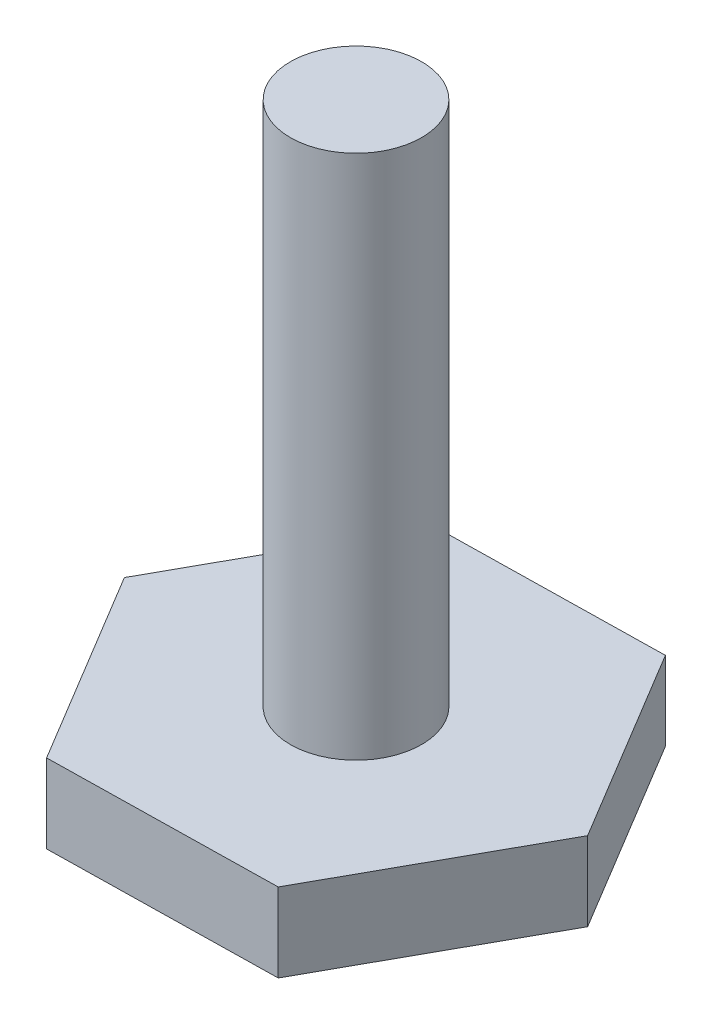
ISO-10303-21;
HEADER;
FILE_DESCRIPTION(('STEP AP214'),'2;1');
FILE_NAME('part.step','',(''),(''),'','','');
FILE_SCHEMA(('AUTOMOTIVE_DESIGN { 1 0 10303 214 1 1 1 1 }'));
ENDSEC;
DATA;
#1=APPLICATION_CONTEXT('core data for automotive mechanical design processes');
#2=APPLICATION_PROTOCOL_DEFINITION('international standard','automotive_design',2000,#1);
#3=PRODUCT_CONTEXT('',#1,'mechanical');
#4=PRODUCT('Part','Part','',(#3));
#5=PRODUCT_RELATED_PRODUCT_CATEGORY('part','',(#4));
#6=PRODUCT_DEFINITION_FORMATION('','',#4);
#7=PRODUCT_DEFINITION_CONTEXT('part definition',#1,'design');
#8=PRODUCT_DEFINITION('design','',#6,#7);
#9=PRODUCT_DEFINITION_SHAPE('','',#8);
#10=(LENGTH_UNIT() NAMED_UNIT(*) SI_UNIT(.MILLI.,.METRE.));
#11=(NAMED_UNIT(*) PLANE_ANGLE_UNIT() SI_UNIT($,.RADIAN.));
#12=(NAMED_UNIT(*) SI_UNIT($,.STERADIAN.) SOLID_ANGLE_UNIT());
#13=UNCERTAINTY_MEASURE_WITH_UNIT(LENGTH_MEASURE(1.E-05),#10,'distance_accuracy_value','');
#14=(GEOMETRIC_REPRESENTATION_CONTEXT(3) GLOBAL_UNCERTAINTY_ASSIGNED_CONTEXT((#13)) GLOBAL_UNIT_ASSIGNED_CONTEXT((#10,
#11,#12)) REPRESENTATION_CONTEXT('',''));
#15=CARTESIAN_POINT('',(0.,0.,0.));
#16=DIRECTION('',(0.,0.,1.));
#17=DIRECTION('',(1.,0.,0.));
#18=AXIS2_PLACEMENT_3D('',#15,#16,#17);
#19=CARTESIAN_POINT('',(17.8510178826156,12.,29.6873905986117));
#20=DIRECTION('',(0.,1.,0.));
#21=DIRECTION('',(0.,0.,1.));
#22=AXIS2_PLACEMENT_3D('',#19,#20,#21);
#23=PLANE('',#22);
#24=DIRECTION('',(0.999842014461216,0.,-0.0177748732242399));
#25=VECTOR('',#24,1.);
#26=CARTESIAN_POINT('',(-16.7845254891612,12.,30.3031302690613));
#27=LINE('',#26,#25);
#28=CARTESIAN_POINT('',(-16.7845254891612,12.,30.3031302690613));
#29=VERTEX_POINT('',#28);
#30=CARTESIAN_POINT('',(17.8510178826156,12.,29.6873905986117));
#31=VERTEX_POINT('',#30);
#32=EDGE_CURVE('E127',#29,#31,#27,.T.);
#33=ORIENTED_EDGE('',*,*,#32,.T.);
#34=DIRECTION('',(0.484527515469368,0.,-0.874776020906541));
#35=VECTOR('',#34,1.);
#36=CARTESIAN_POINT('',(17.8510178826156,12.,29.6873905986117));
#37=LINE('',#36,#35);
#38=CARTESIAN_POINT('',(34.6355433717768,12.,-0.615739670449589));
#39=VERTEX_POINT('',#38);
#40=EDGE_CURVE('E85',#31,#39,#37,.T.);
#41=ORIENTED_EDGE('',*,*,#40,.T.);
#42=DIRECTION('',(-0.515314498991847,0.,-0.857001147682301));
#43=VECTOR('',#42,1.);
#44=CARTESIAN_POINT('',(34.6355433717768,12.,-0.615739670449589));
#45=LINE('',#44,#43);
#46=CARTESIAN_POINT('',(16.7845254891612,12.,-30.3031302690613));
#47=VERTEX_POINT('',#46);
#48=EDGE_CURVE('E98',#39,#47,#45,.T.);
#49=ORIENTED_EDGE('',*,*,#48,.T.);
#50=DIRECTION('',(-0.999842014461216,0.,0.0177748732242397));
#51=VECTOR('',#50,1.);
#52=CARTESIAN_POINT('',(16.7845254891612,12.,-30.3031302690613));
#53=LINE('',#52,#51);
#54=CARTESIAN_POINT('',(-17.8510178826156,12.,-29.6873905986117));
#55=VERTEX_POINT('',#54);
#56=EDGE_CURVE('E92',#47,#55,#53,.T.);
#57=ORIENTED_EDGE('',*,*,#56,.T.);
#58=DIRECTION('',(-0.484527515469369,0.,0.874776020906541));
#59=VECTOR('',#58,1.);
#60=CARTESIAN_POINT('',(-17.8510178826156,12.,-29.6873905986117));
#61=LINE('',#60,#59);
#62=CARTESIAN_POINT('',(-34.6355433717768,12.,0.61573967044958));
#63=VERTEX_POINT('',#62);
#64=EDGE_CURVE('E96',#55,#63,#61,.T.);
#65=ORIENTED_EDGE('',*,*,#64,.T.);
#66=DIRECTION('',(0.515314498991847,0.,0.857001147682301));
#67=VECTOR('',#66,1.);
#68=CARTESIAN_POINT('',(-34.6355433717768,12.,0.61573967044958));
#69=LINE('',#68,#67);
#70=EDGE_CURVE('E48',#63,#29,#69,.T.);
#71=ORIENTED_EDGE('',*,*,#70,.T.);
#72=EDGE_LOOP('',(#33,#41,#49,#57,#65,#71));
#73=FACE_BOUND('',#72,.T.);
#74=CARTESIAN_POINT('',(0.,12.,0.));
#75=DIRECTION('',(0.,1.,0.));
#76=DIRECTION('',(0.,0.,1.));
#77=AXIS2_PLACEMENT_3D('',#74,#75,#76);
#78=CIRCLE('',#77,10.);
#79=CARTESIAN_POINT('',(0.,12.,10.));
#80=VERTEX_POINT('',#79);
#81=EDGE_CURVE('E167',#80,#80,#78,.T.);
#82=ORIENTED_EDGE('',*,*,#81,.F.);
#83=EDGE_LOOP('',(#82));
#84=FACE_BOUND('',#83,.T.);
#85=ADVANCED_FACE('F31',(#73,#84),#23,.T.);
#86=CARTESIAN_POINT('',(-16.7845254891612,12.,30.3031302690613));
#87=DIRECTION('',(-0.0177748732242399,0.,-0.999842014461216));
#88=DIRECTION('',(-0.999842014461216,0.,0.0177748732242399));
#89=AXIS2_PLACEMENT_3D('',#86,#87,#88);
#90=PLANE('',#89);
#91=DIRECTION('',(0.999842014461216,0.,-0.0177748732242399));
#92=VECTOR('',#91,1.);
#93=CARTESIAN_POINT('',(-16.7845254891612,0.,30.3031302690613));
#94=LINE('',#93,#92);
#95=CARTESIAN_POINT('',(-16.7845254891612,0.,30.3031302690613));
#96=VERTEX_POINT('',#95);
#97=CARTESIAN_POINT('',(17.8510178826156,0.,29.6873905986117));
#98=VERTEX_POINT('',#97);
#99=EDGE_CURVE('E116',#96,#98,#94,.T.);
#100=ORIENTED_EDGE('',*,*,#99,.T.);
#101=DIRECTION('',(0.,-1.,0.));
#102=VECTOR('',#101,1.);
#103=CARTESIAN_POINT('',(17.8510178826156,12.,29.6873905986117));
#104=LINE('',#103,#102);
#105=EDGE_CURVE('E11',#31,#98,#104,.T.);
#106=ORIENTED_EDGE('',*,*,#105,.F.);
#107=ORIENTED_EDGE('',*,*,#32,.F.);
#108=DIRECTION('',(0.,-1.,0.));
#109=VECTOR('',#108,1.);
#110=CARTESIAN_POINT('',(-16.7845254891612,12.,30.3031302690613));
#111=LINE('',#110,#109);
#112=EDGE_CURVE('E112',#29,#96,#111,.T.);
#113=ORIENTED_EDGE('',*,*,#112,.T.);
#114=EDGE_LOOP('',(#100,#106,#107,#113));
#115=FACE_BOUND('',#114,.T.);
#116=ADVANCED_FACE('F33',(#115),#90,.F.);
#117=CARTESIAN_POINT('',(17.8510178826156,12.,29.6873905986117));
#118=DIRECTION('',(-0.874776020906541,0.,-0.484527515469368));
#119=DIRECTION('',(-0.484527515469368,0.,0.874776020906541));
#120=AXIS2_PLACEMENT_3D('',#117,#118,#119);
#121=PLANE('',#120);
#122=DIRECTION('',(0.484527515469368,0.,-0.874776020906541));
#123=VECTOR('',#122,1.);
#124=CARTESIAN_POINT('',(17.8510178826156,0.,29.6873905986117));
#125=LINE('',#124,#123);
#126=CARTESIAN_POINT('',(34.6355433717768,0.,-0.615739670449589));
#127=VERTEX_POINT('',#126);
#128=EDGE_CURVE('E119',#98,#127,#125,.T.);
#129=ORIENTED_EDGE('',*,*,#128,.T.);
#130=DIRECTION('',(0.,-1.,0.));
#131=VECTOR('',#130,1.);
#132=CARTESIAN_POINT('',(34.6355433717768,12.,-0.615739670449589));
#133=LINE('',#132,#131);
#134=EDGE_CURVE('E40',#39,#127,#133,.T.);
#135=ORIENTED_EDGE('',*,*,#134,.F.);
#136=ORIENTED_EDGE('',*,*,#40,.F.);
#137=ORIENTED_EDGE('',*,*,#105,.T.);
#138=EDGE_LOOP('',(#129,#135,#136,#137));
#139=FACE_BOUND('',#138,.T.);
#140=ADVANCED_FACE('F155',(#139),#121,.F.);
#141=CARTESIAN_POINT('',(34.6355433717768,12.,-0.615739670449589));
#142=DIRECTION('',(-0.857001147682301,0.,0.515314498991848));
#143=DIRECTION('',(0.515314498991848,0.,0.857001147682301));
#144=AXIS2_PLACEMENT_3D('',#141,#142,#143);
#145=PLANE('',#144);
#146=DIRECTION('',(-0.515314498991847,0.,-0.857001147682301));
#147=VECTOR('',#146,1.);
#148=CARTESIAN_POINT('',(34.6355433717768,0.,-0.615739670449589));
#149=LINE('',#148,#147);
#150=CARTESIAN_POINT('',(16.7845254891612,0.,-30.3031302690613));
#151=VERTEX_POINT('',#150);
#152=EDGE_CURVE('E122',#127,#151,#149,.T.);
#153=ORIENTED_EDGE('',*,*,#152,.T.);
#154=DIRECTION('',(0.,-1.,0.));
#155=VECTOR('',#154,1.);
#156=CARTESIAN_POINT('',(16.7845254891612,12.,-30.3031302690613));
#157=LINE('',#156,#155);
#158=EDGE_CURVE('E107',#47,#151,#157,.T.);
#159=ORIENTED_EDGE('',*,*,#158,.F.);
#160=ORIENTED_EDGE('',*,*,#48,.F.);
#161=ORIENTED_EDGE('',*,*,#134,.T.);
#162=EDGE_LOOP('',(#153,#159,#160,#161));
#163=FACE_BOUND('',#162,.T.);
#164=ADVANCED_FACE('F133',(#163),#145,.F.);
#165=CARTESIAN_POINT('',(16.7845254891612,12.,-30.3031302690613));
#166=DIRECTION('',(0.0177748732242397,0.,0.999842014461216));
#167=DIRECTION('',(0.999842014461216,0.,-0.0177748732242397));
#168=AXIS2_PLACEMENT_3D('',#165,#166,#167);
#169=PLANE('',#168);
#170=DIRECTION('',(-0.999842014461216,0.,0.0177748732242397));
#171=VECTOR('',#170,1.);
#172=CARTESIAN_POINT('',(16.7845254891612,0.,-30.3031302690613));
#173=LINE('',#172,#171);
#174=CARTESIAN_POINT('',(-17.8510178826156,0.,-29.6873905986117));
#175=VERTEX_POINT('',#174);
#176=EDGE_CURVE('E106',#151,#175,#173,.T.);
#177=ORIENTED_EDGE('',*,*,#176,.T.);
#178=DIRECTION('',(0.,-1.,0.));
#179=VECTOR('',#178,1.);
#180=CARTESIAN_POINT('',(-17.8510178826156,12.,-29.6873905986117));
#181=LINE('',#180,#179);
#182=EDGE_CURVE('E103',#55,#175,#181,.T.);
#183=ORIENTED_EDGE('',*,*,#182,.F.);
#184=ORIENTED_EDGE('',*,*,#56,.F.);
#185=ORIENTED_EDGE('',*,*,#158,.T.);
#186=EDGE_LOOP('',(#177,#183,#184,#185));
#187=FACE_BOUND('',#186,.T.);
#188=ADVANCED_FACE('F104',(#187),#169,.F.);
#189=CARTESIAN_POINT('',(-17.8510178826156,12.,-29.6873905986117));
#190=DIRECTION('',(0.874776020906541,0.,0.484527515469369));
#191=DIRECTION('',(0.484527515469369,0.,-0.874776020906541));
#192=AXIS2_PLACEMENT_3D('',#189,#190,#191);
#193=PLANE('',#192);
#194=DIRECTION('',(-0.484527515469369,0.,0.874776020906541));
#195=VECTOR('',#194,1.);
#196=CARTESIAN_POINT('',(-17.8510178826156,0.,-29.6873905986117));
#197=LINE('',#196,#195);
#198=CARTESIAN_POINT('',(-34.6355433717768,0.,0.61573967044958));
#199=VERTEX_POINT('',#198);
#200=EDGE_CURVE('E71',#175,#199,#197,.T.);
#201=ORIENTED_EDGE('',*,*,#200,.T.);
#202=DIRECTION('',(0.,-1.,0.));
#203=VECTOR('',#202,1.);
#204=CARTESIAN_POINT('',(-34.6355433717768,12.,0.61573967044958));
#205=LINE('',#204,#203);
#206=EDGE_CURVE('E108',#63,#199,#205,.T.);
#207=ORIENTED_EDGE('',*,*,#206,.F.);
#208=ORIENTED_EDGE('',*,*,#64,.F.);
#209=ORIENTED_EDGE('',*,*,#182,.T.);
#210=EDGE_LOOP('',(#201,#207,#208,#209));
#211=FACE_BOUND('',#210,.T.);
#212=ADVANCED_FACE('F110',(#211),#193,.F.);
#213=CARTESIAN_POINT('',(-34.6355433717768,12.,0.61573967044958));
#214=DIRECTION('',(0.857001147682301,0.,-0.515314498991847));
#215=DIRECTION('',(-0.515314498991847,0.,-0.857001147682301));
#216=AXIS2_PLACEMENT_3D('',#213,#214,#215);
#217=PLANE('',#216);
#218=DIRECTION('',(0.515314498991847,0.,0.857001147682301));
#219=VECTOR('',#218,1.);
#220=CARTESIAN_POINT('',(-34.6355433717768,0.,0.61573967044958));
#221=LINE('',#220,#219);
#222=EDGE_CURVE('E77',#199,#96,#221,.T.);
#223=ORIENTED_EDGE('',*,*,#222,.T.);
#224=ORIENTED_EDGE('',*,*,#112,.F.);
#225=ORIENTED_EDGE('',*,*,#70,.F.);
#226=ORIENTED_EDGE('',*,*,#206,.T.);
#227=EDGE_LOOP('',(#223,#224,#225,#226));
#228=FACE_BOUND('',#227,.T.);
#229=ADVANCED_FACE('F140',(#228),#217,.F.);
#230=CARTESIAN_POINT('',(17.8510178826156,0.,29.6873905986117));
#231=DIRECTION('',(0.,1.,0.));
#232=DIRECTION('',(0.,0.,1.));
#233=AXIS2_PLACEMENT_3D('',#230,#231,#232);
#234=PLANE('',#233);
#235=ORIENTED_EDGE('',*,*,#99,.F.);
#236=ORIENTED_EDGE('',*,*,#222,.F.);
#237=ORIENTED_EDGE('',*,*,#200,.F.);
#238=ORIENTED_EDGE('',*,*,#176,.F.);
#239=ORIENTED_EDGE('',*,*,#152,.F.);
#240=ORIENTED_EDGE('',*,*,#128,.F.);
#241=EDGE_LOOP('',(#235,#236,#237,#238,#239,#240));
#242=FACE_BOUND('',#241,.T.);
#243=ADVANCED_FACE('F136',(#242),#234,.F.);
#244=CARTESIAN_POINT('',(0.,92.,0.));
#245=DIRECTION('',(0.,-1.,0.));
#246=DIRECTION('',(0.,0.,-1.));
#247=AXIS2_PLACEMENT_3D('',#244,#245,#246);
#248=CYLINDRICAL_SURFACE('',#247,10.);
#249=CARTESIAN_POINT('',(0.,92.,0.));
#250=DIRECTION('',(0.,1.,0.));
#251=DIRECTION('',(0.,0.,1.));
#252=AXIS2_PLACEMENT_3D('',#249,#250,#251);
#253=CIRCLE('',#252,10.);
#254=CARTESIAN_POINT('',(0.,92.,10.));
#255=VERTEX_POINT('',#254);
#256=EDGE_CURVE('E120',#255,#255,#253,.T.);
#257=ORIENTED_EDGE('',*,*,#256,.F.);
#258=EDGE_LOOP('',(#257));
#259=FACE_BOUND('',#258,.T.);
#260=ORIENTED_EDGE('',*,*,#81,.T.);
#261=EDGE_LOOP('',(#260));
#262=FACE_BOUND('',#261,.T.);
#263=ADVANCED_FACE('F147',(#259,#262),#248,.T.);
#264=CARTESIAN_POINT('',(0.,92.,0.));
#265=DIRECTION('',(0.,1.,0.));
#266=DIRECTION('',(0.,0.,1.));
#267=AXIS2_PLACEMENT_3D('',#264,#265,#266);
#268=PLANE('',#267);
#269=ORIENTED_EDGE('',*,*,#256,.T.);
#270=EDGE_LOOP('',(#269));
#271=FACE_BOUND('',#270,.T.);
#272=ADVANCED_FACE('F159',(#271),#268,.T.);
#273=CLOSED_SHELL('',(#85,#116,#140,#164,#188,#212,#229,#243,#263,#272));
#274=MANIFOLD_SOLID_BREP('B2',#273);
#275=ADVANCED_BREP_SHAPE_REPRESENTATION('',(#18,#274),#14);
#276=SHAPE_DEFINITION_REPRESENTATION(#9,#275);
ENDSEC;
END-ISO-10303-21;
